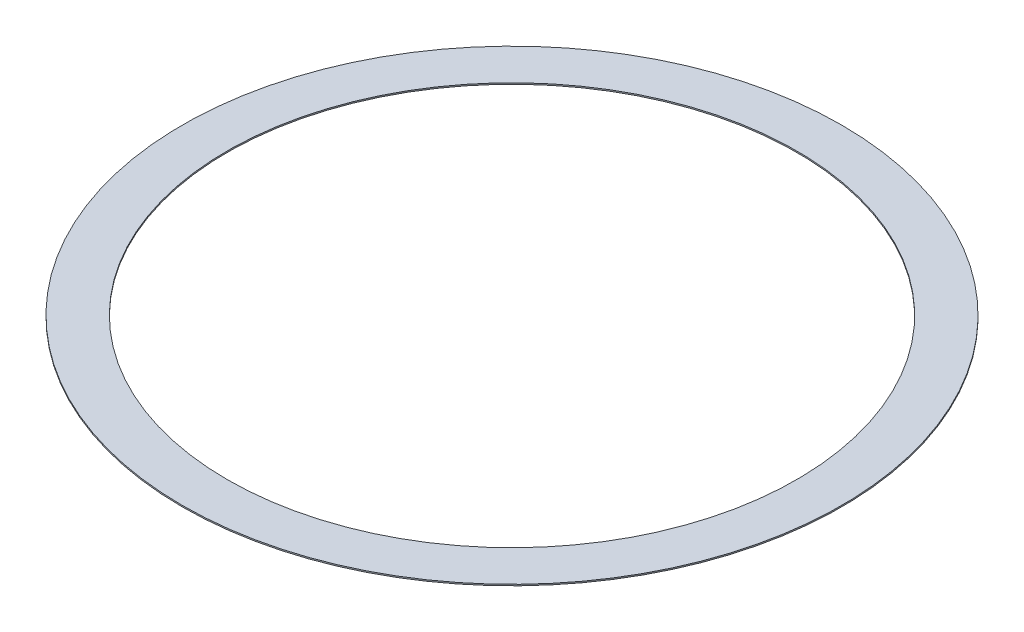
ISO-10303-21;
HEADER;
FILE_DESCRIPTION(('STEP AP214'),'2;1');
FILE_NAME('part.step','',(''),(''),'','','');
FILE_SCHEMA(('AUTOMOTIVE_DESIGN { 1 0 10303 214 1 1 1 1 }'));
ENDSEC;
DATA;
#1=APPLICATION_CONTEXT('core data for automotive mechanical design processes');
#2=APPLICATION_PROTOCOL_DEFINITION('international standard','automotive_design',2000,#1);
#3=PRODUCT_CONTEXT('',#1,'mechanical');
#4=PRODUCT('Part','Part','',(#3));
#5=PRODUCT_RELATED_PRODUCT_CATEGORY('part','',(#4));
#6=PRODUCT_DEFINITION_FORMATION('','',#4);
#7=PRODUCT_DEFINITION_CONTEXT('part definition',#1,'design');
#8=PRODUCT_DEFINITION('design','',#6,#7);
#9=PRODUCT_DEFINITION_SHAPE('','',#8);
#10=(LENGTH_UNIT() NAMED_UNIT(*) SI_UNIT(.MILLI.,.METRE.));
#11=(NAMED_UNIT(*) PLANE_ANGLE_UNIT() SI_UNIT($,.RADIAN.));
#12=(NAMED_UNIT(*) SI_UNIT($,.STERADIAN.) SOLID_ANGLE_UNIT());
#13=UNCERTAINTY_MEASURE_WITH_UNIT(LENGTH_MEASURE(1.E-05),#10,'distance_accuracy_value','');
#14=(GEOMETRIC_REPRESENTATION_CONTEXT(3) GLOBAL_UNCERTAINTY_ASSIGNED_CONTEXT((#13)) GLOBAL_UNIT_ASSIGNED_CONTEXT((#10,
#11,#12)) REPRESENTATION_CONTEXT('',''));
#15=CARTESIAN_POINT('',(0.,0.,0.));
#16=DIRECTION('',(0.,0.,1.));
#17=DIRECTION('',(1.,0.,0.));
#18=AXIS2_PLACEMENT_3D('',#15,#16,#17);
#19=CARTESIAN_POINT('',(0.,0.1016,0.));
#20=DIRECTION('',(0.,1.,0.));
#21=DIRECTION('',(0.,0.,1.));
#22=AXIS2_PLACEMENT_3D('',#19,#20,#21);
#23=PLANE('',#22);
#24=CARTESIAN_POINT('',(0.,0.1016,0.));
#25=DIRECTION('',(0.,1.,0.));
#26=DIRECTION('',(0.,0.,1.));
#27=AXIS2_PLACEMENT_3D('',#24,#25,#26);
#28=CIRCLE('',#27,25.2095);
#29=CARTESIAN_POINT('',(0.,0.1016,25.2095));
#30=VERTEX_POINT('',#29);
#31=EDGE_CURVE('E10',#30,#30,#28,.T.);
#32=ORIENTED_EDGE('',*,*,#31,.T.);
#33=EDGE_LOOP('',(#32));
#34=FACE_BOUND('',#33,.T.);
#35=CARTESIAN_POINT('',(0.,0.1016,0.));
#36=DIRECTION('',(0.,1.,0.));
#37=DIRECTION('',(0.,0.,1.));
#38=AXIS2_PLACEMENT_3D('',#35,#36,#37);
#39=CIRCLE('',#38,21.7805);
#40=CARTESIAN_POINT('',(0.,0.1016,21.7805));
#41=VERTEX_POINT('',#40);
#42=EDGE_CURVE('E45',#41,#41,#39,.T.);
#43=ORIENTED_EDGE('',*,*,#42,.F.);
#44=EDGE_LOOP('',(#43));
#45=FACE_BOUND('',#44,.T.);
#46=ADVANCED_FACE('F34',(#34,#45),#23,.T.);
#47=CARTESIAN_POINT('',(0.,0.,0.));
#48=DIRECTION('',(0.,1.,0.));
#49=DIRECTION('',(0.,0.,1.));
#50=AXIS2_PLACEMENT_3D('',#47,#48,#49);
#51=PLANE('',#50);
#52=CARTESIAN_POINT('',(0.,0.,0.));
#53=DIRECTION('',(0.,1.,0.));
#54=DIRECTION('',(0.,0.,1.));
#55=AXIS2_PLACEMENT_3D('',#52,#53,#54);
#56=CIRCLE('',#55,25.2095);
#57=CARTESIAN_POINT('',(0.,0.,25.2095));
#58=VERTEX_POINT('',#57);
#59=EDGE_CURVE('E38',#58,#58,#56,.T.);
#60=ORIENTED_EDGE('',*,*,#59,.F.);
#61=EDGE_LOOP('',(#60));
#62=FACE_BOUND('',#61,.T.);
#63=CARTESIAN_POINT('',(0.,0.,0.));
#64=DIRECTION('',(0.,1.,0.));
#65=DIRECTION('',(0.,0.,1.));
#66=AXIS2_PLACEMENT_3D('',#63,#64,#65);
#67=CIRCLE('',#66,21.7805);
#68=CARTESIAN_POINT('',(0.,0.,21.7805));
#69=VERTEX_POINT('',#68);
#70=EDGE_CURVE('E47',#69,#69,#67,.T.);
#71=ORIENTED_EDGE('',*,*,#70,.T.);
#72=EDGE_LOOP('',(#71));
#73=FACE_BOUND('',#72,.T.);
#74=ADVANCED_FACE('F57',(#62,#73),#51,.F.);
#75=CARTESIAN_POINT('',(0.,0.1016,0.));
#76=DIRECTION('',(0.,-1.,0.));
#77=DIRECTION('',(0.,0.,-1.));
#78=AXIS2_PLACEMENT_3D('',#75,#76,#77);
#79=CYLINDRICAL_SURFACE('',#78,25.2095);
#80=ORIENTED_EDGE('',*,*,#31,.F.);
#81=EDGE_LOOP('',(#80));
#82=FACE_BOUND('',#81,.T.);
#83=ORIENTED_EDGE('',*,*,#59,.T.);
#84=EDGE_LOOP('',(#83));
#85=FACE_BOUND('',#84,.T.);
#86=ADVANCED_FACE('F36',(#82,#85),#79,.T.);
#87=CARTESIAN_POINT('',(0.,0.1016,0.));
#88=DIRECTION('',(0.,-1.,0.));
#89=DIRECTION('',(0.,0.,-1.));
#90=AXIS2_PLACEMENT_3D('',#87,#88,#89);
#91=CYLINDRICAL_SURFACE('',#90,21.7805);
#92=ORIENTED_EDGE('',*,*,#42,.T.);
#93=EDGE_LOOP('',(#92));
#94=FACE_BOUND('',#93,.T.);
#95=ORIENTED_EDGE('',*,*,#70,.F.);
#96=EDGE_LOOP('',(#95));
#97=FACE_BOUND('',#96,.T.);
#98=ADVANCED_FACE('F53',(#94,#97),#91,.F.);
#99=CLOSED_SHELL('',(#46,#74,#86,#98));
#100=MANIFOLD_SOLID_BREP('B2',#99);
#101=ADVANCED_BREP_SHAPE_REPRESENTATION('',(#18,#100),#14);
#102=SHAPE_DEFINITION_REPRESENTATION(#9,#101);
ENDSEC;
END-ISO-10303-21;
